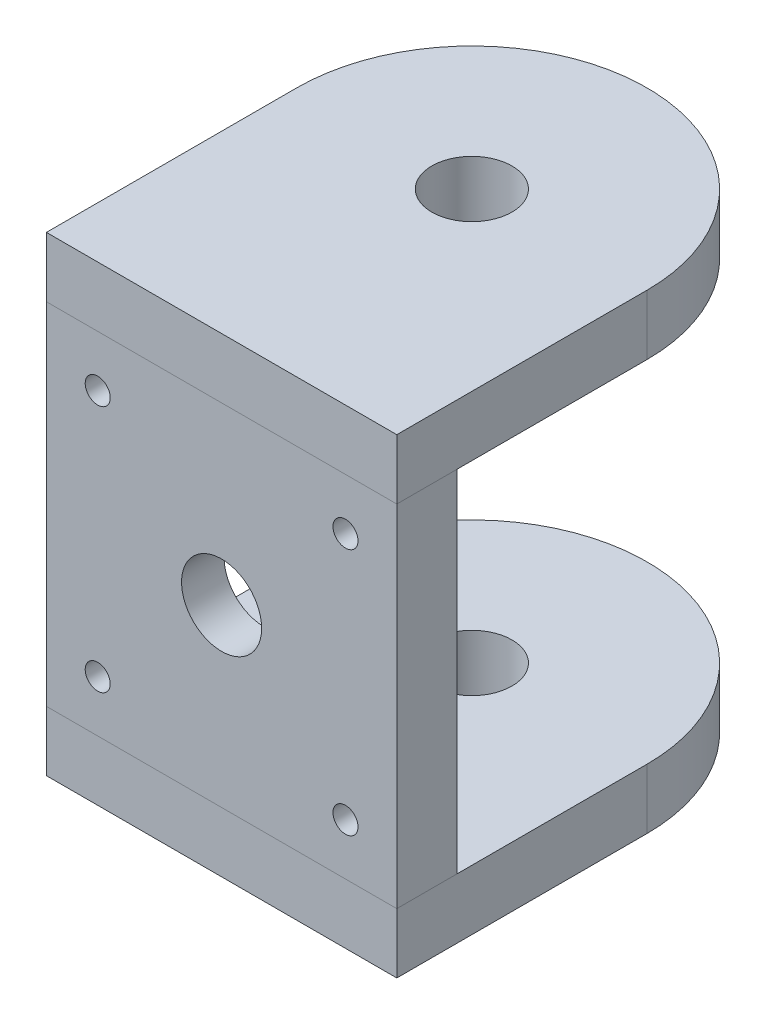
ISO-10303-21;
HEADER;
FILE_DESCRIPTION(('STEP AP214'),'2;1');
FILE_NAME('part.step','',(''),(''),'','','');
FILE_SCHEMA(('AUTOMOTIVE_DESIGN { 1 0 10303 214 1 1 1 1 }'));
ENDSEC;
DATA;
#1=APPLICATION_CONTEXT('core data for automotive mechanical design processes');
#2=APPLICATION_PROTOCOL_DEFINITION('international standard','automotive_design',2000,#1);
#3=PRODUCT_CONTEXT('',#1,'mechanical');
#4=PRODUCT('Part','Part','',(#3));
#5=PRODUCT_RELATED_PRODUCT_CATEGORY('part','',(#4));
#6=PRODUCT_DEFINITION_FORMATION('','',#4);
#7=PRODUCT_DEFINITION_CONTEXT('part definition',#1,'design');
#8=PRODUCT_DEFINITION('design','',#6,#7);
#9=PRODUCT_DEFINITION_SHAPE('','',#8);
#10=(LENGTH_UNIT() NAMED_UNIT(*) SI_UNIT(.MILLI.,.METRE.));
#11=(NAMED_UNIT(*) PLANE_ANGLE_UNIT() SI_UNIT($,.RADIAN.));
#12=(NAMED_UNIT(*) SI_UNIT($,.STERADIAN.) SOLID_ANGLE_UNIT());
#13=UNCERTAINTY_MEASURE_WITH_UNIT(LENGTH_MEASURE(1.E-05),#10,'distance_accuracy_value','');
#14=(GEOMETRIC_REPRESENTATION_CONTEXT(3) GLOBAL_UNCERTAINTY_ASSIGNED_CONTEXT((#13)) GLOBAL_UNIT_ASSIGNED_CONTEXT((#10,
#11,#12)) REPRESENTATION_CONTEXT('',''));
#15=CARTESIAN_POINT('',(0.,0.,0.));
#16=DIRECTION('',(0.,0.,1.));
#17=DIRECTION('',(1.,0.,0.));
#18=AXIS2_PLACEMENT_3D('',#15,#16,#17);
#19=CARTESIAN_POINT('',(35.,-47.,12.));
#20=DIRECTION('',(-1.,0.,0.));
#21=DIRECTION('',(0.,0.,1.));
#22=AXIS2_PLACEMENT_3D('',#19,#20,#21);
#23=PLANE('',#22);
#24=DIRECTION('',(0.,1.,0.));
#25=VECTOR('',#24,1.);
#26=CARTESIAN_POINT('',(35.,-47.,-38.));
#27=LINE('',#26,#25);
#28=CARTESIAN_POINT('',(35.,-47.,-38.));
#29=VERTEX_POINT('',#28);
#30=CARTESIAN_POINT('',(35.,-35.,-38.));
#31=VERTEX_POINT('',#30);
#32=EDGE_CURVE('E111',#29,#31,#27,.T.);
#33=ORIENTED_EDGE('',*,*,#32,.T.);
#34=DIRECTION('',(0.,0.,-1.));
#35=VECTOR('',#34,1.);
#36=CARTESIAN_POINT('',(35.,-35.,12.));
#37=LINE('',#36,#35);
#38=CARTESIAN_POINT('',(35.,-35.,12.));
#39=VERTEX_POINT('',#38);
#40=EDGE_CURVE('E97',#39,#31,#37,.T.);
#41=ORIENTED_EDGE('',*,*,#40,.F.);
#42=DIRECTION('',(0.,1.,0.));
#43=VECTOR('',#42,1.);
#44=CARTESIAN_POINT('',(35.,-47.,12.));
#45=LINE('',#44,#43);
#46=CARTESIAN_POINT('',(35.,-47.,12.));
#47=VERTEX_POINT('',#46);
#48=EDGE_CURVE('E104',#47,#39,#45,.T.);
#49=ORIENTED_EDGE('',*,*,#48,.F.);
#50=DIRECTION('',(0.,0.,-1.));
#51=VECTOR('',#50,1.);
#52=CARTESIAN_POINT('',(35.,-47.,12.));
#53=LINE('',#52,#51);
#54=EDGE_CURVE('E101',#47,#29,#53,.T.);
#55=ORIENTED_EDGE('',*,*,#54,.T.);
#56=EDGE_LOOP('',(#33,#41,#49,#55));
#57=FACE_BOUND('',#56,.T.);
#58=ADVANCED_FACE('F58',(#57),#23,.F.);
#59=CARTESIAN_POINT('',(-35.,-47.,12.));
#60=DIRECTION('',(1.,0.,0.));
#61=DIRECTION('',(0.,0.,-1.));
#62=AXIS2_PLACEMENT_3D('',#59,#60,#61);
#63=PLANE('',#62);
#64=DIRECTION('',(0.,0.,1.));
#65=VECTOR('',#64,1.);
#66=CARTESIAN_POINT('',(-35.,-35.,12.));
#67=LINE('',#66,#65);
#68=CARTESIAN_POINT('',(-35.,-35.,-38.));
#69=VERTEX_POINT('',#68);
#70=CARTESIAN_POINT('',(-35.,-35.,12.));
#71=VERTEX_POINT('',#70);
#72=EDGE_CURVE('E99',#69,#71,#67,.T.);
#73=ORIENTED_EDGE('',*,*,#72,.F.);
#74=DIRECTION('',(0.,1.,0.));
#75=VECTOR('',#74,1.);
#76=CARTESIAN_POINT('',(-35.,-47.,-38.));
#77=LINE('',#76,#75);
#78=CARTESIAN_POINT('',(-35.,-47.,-38.));
#79=VERTEX_POINT('',#78);
#80=EDGE_CURVE('E72',#79,#69,#77,.T.);
#81=ORIENTED_EDGE('',*,*,#80,.F.);
#82=DIRECTION('',(0.,0.,1.));
#83=VECTOR('',#82,1.);
#84=CARTESIAN_POINT('',(-35.,-47.,12.));
#85=LINE('',#84,#83);
#86=CARTESIAN_POINT('',(-35.,-47.,12.));
#87=VERTEX_POINT('',#86);
#88=EDGE_CURVE('E123',#79,#87,#85,.T.);
#89=ORIENTED_EDGE('',*,*,#88,.T.);
#90=DIRECTION('',(0.,1.,0.));
#91=VECTOR('',#90,1.);
#92=CARTESIAN_POINT('',(-35.,-47.,12.));
#93=LINE('',#92,#91);
#94=EDGE_CURVE('E65',#87,#71,#93,.T.);
#95=ORIENTED_EDGE('',*,*,#94,.T.);
#96=EDGE_LOOP('',(#73,#81,#89,#95));
#97=FACE_BOUND('',#96,.T.);
#98=ADVANCED_FACE('F121',(#97),#63,.F.);
#99=CARTESIAN_POINT('',(35.,-47.,12.));
#100=DIRECTION('',(0.,0.,-1.));
#101=DIRECTION('',(-1.,0.,0.));
#102=AXIS2_PLACEMENT_3D('',#99,#100,#101);
#103=PLANE('',#102);
#104=DIRECTION('',(1.,0.,0.));
#105=VECTOR('',#104,1.);
#106=CARTESIAN_POINT('',(35.,-35.,12.));
#107=LINE('',#106,#105);
#108=EDGE_CURVE('E94',#71,#39,#107,.T.);
#109=ORIENTED_EDGE('',*,*,#108,.F.);
#110=ORIENTED_EDGE('',*,*,#94,.F.);
#111=DIRECTION('',(1.,0.,0.));
#112=VECTOR('',#111,1.);
#113=CARTESIAN_POINT('',(35.,-47.,12.));
#114=LINE('',#113,#112);
#115=EDGE_CURVE('E80',#87,#47,#114,.T.);
#116=ORIENTED_EDGE('',*,*,#115,.T.);
#117=ORIENTED_EDGE('',*,*,#48,.T.);
#118=EDGE_LOOP('',(#109,#110,#116,#117));
#119=FACE_BOUND('',#118,.T.);
#120=ADVANCED_FACE('F105',(#119),#103,.F.);
#121=CARTESIAN_POINT('',(0.,-47.,0.));
#122=DIRECTION('',(0.,-1.,0.));
#123=DIRECTION('',(0.,0.,1.));
#124=AXIS2_PLACEMENT_3D('',#121,#122,#123);
#125=PLANE('',#124);
#126=CARTESIAN_POINT('',(0.,-47.,-38.));
#127=DIRECTION('',(0.,-1.,0.));
#128=DIRECTION('',(0.,0.,1.));
#129=AXIS2_PLACEMENT_3D('',#126,#127,#128);
#130=CIRCLE('',#129,35.);
#131=EDGE_CURVE('E130',#79,#29,#130,.T.);
#132=ORIENTED_EDGE('',*,*,#131,.T.);
#133=ORIENTED_EDGE('',*,*,#54,.F.);
#134=ORIENTED_EDGE('',*,*,#115,.F.);
#135=ORIENTED_EDGE('',*,*,#88,.F.);
#136=EDGE_LOOP('',(#132,#133,#134,#135));
#137=FACE_BOUND('',#136,.T.);
#138=CARTESIAN_POINT('',(0.,-47.,-38.));
#139=DIRECTION('',(0.,1.,0.));
#140=DIRECTION('',(0.,0.,1.));
#141=AXIS2_PLACEMENT_3D('',#138,#139,#140);
#142=CIRCLE('',#141,8.);
#143=CARTESIAN_POINT('',(0.,-47.,-30.));
#144=VERTEX_POINT('',#143);
#145=EDGE_CURVE('E116',#144,#144,#142,.T.);
#146=ORIENTED_EDGE('',*,*,#145,.T.);
#147=EDGE_LOOP('',(#146));
#148=FACE_BOUND('',#147,.T.);
#149=ADVANCED_FACE('F127',(#137,#148),#125,.T.);
#150=CARTESIAN_POINT('',(0.,-35.,0.));
#151=DIRECTION('',(0.,-1.,0.));
#152=DIRECTION('',(0.,0.,1.));
#153=AXIS2_PLACEMENT_3D('',#150,#151,#152);
#154=PLANE('',#153);
#155=CARTESIAN_POINT('',(0.,-35.,-38.));
#156=DIRECTION('',(0.,-1.,0.));
#157=DIRECTION('',(0.,0.,-1.));
#158=AXIS2_PLACEMENT_3D('',#155,#156,#157);
#159=CIRCLE('',#158,8.);
#160=CARTESIAN_POINT('',(0.,-35.,-46.));
#161=VERTEX_POINT('',#160);
#162=EDGE_CURVE('E112',#161,#161,#159,.T.);
#163=ORIENTED_EDGE('',*,*,#162,.T.);
#164=EDGE_LOOP('',(#163));
#165=FACE_BOUND('',#164,.T.);
#166=ORIENTED_EDGE('',*,*,#40,.T.);
#167=CARTESIAN_POINT('',(0.,-35.,-38.));
#168=DIRECTION('',(0.,-1.,0.));
#169=DIRECTION('',(0.,0.,-1.));
#170=AXIS2_PLACEMENT_3D('',#167,#168,#169);
#171=CIRCLE('',#170,35.);
#172=EDGE_CURVE('E12',#31,#69,#171,.F.);
#173=ORIENTED_EDGE('',*,*,#172,.T.);
#174=ORIENTED_EDGE('',*,*,#72,.T.);
#175=ORIENTED_EDGE('',*,*,#108,.T.);
#176=EDGE_LOOP('',(#166,#173,#174,#175));
#177=FACE_BOUND('',#176,.T.);
#178=ADVANCED_FACE('F95',(#165,#177),#154,.F.);
#179=CARTESIAN_POINT('',(0.,-47.,-38.));
#180=DIRECTION('',(0.,1.,0.));
#181=DIRECTION('',(0.,0.,1.));
#182=AXIS2_PLACEMENT_3D('',#179,#180,#181);
#183=CYLINDRICAL_SURFACE('',#182,8.);
#184=ORIENTED_EDGE('',*,*,#145,.F.);
#185=EDGE_LOOP('',(#184));
#186=FACE_BOUND('',#185,.T.);
#187=ORIENTED_EDGE('',*,*,#162,.F.);
#188=EDGE_LOOP('',(#187));
#189=FACE_BOUND('',#188,.T.);
#190=ADVANCED_FACE('F143',(#186,#189),#183,.F.);
#191=CARTESIAN_POINT('',(0.,-47.,-38.));
#192=DIRECTION('',(0.,1.,0.));
#193=DIRECTION('',(0.,0.,1.));
#194=AXIS2_PLACEMENT_3D('',#191,#192,#193);
#195=CYLINDRICAL_SURFACE('',#194,35.);
#196=ORIENTED_EDGE('',*,*,#32,.F.);
#197=ORIENTED_EDGE('',*,*,#131,.F.);
#198=ORIENTED_EDGE('',*,*,#80,.T.);
#199=ORIENTED_EDGE('',*,*,#172,.F.);
#200=EDGE_LOOP('',(#196,#197,#198,#199));
#201=FACE_BOUND('',#200,.T.);
#202=ADVANCED_FACE('F146',(#201),#195,.T.);
#203=CLOSED_SHELL('',(#58,#98,#120,#149,#178,#190,#202));
#204=MANIFOLD_SOLID_BREP('B2',#203);
#205=CARTESIAN_POINT('',(35.,47.,12.));
#206=DIRECTION('',(-1.,0.,0.));
#207=DIRECTION('',(0.,0.,1.));
#208=AXIS2_PLACEMENT_3D('',#205,#206,#207);
#209=PLANE('',#208);
#210=DIRECTION('',(0.,1.,0.));
#211=VECTOR('',#210,1.);
#212=CARTESIAN_POINT('',(35.,-47.,-38.));
#213=LINE('',#212,#211);
#214=CARTESIAN_POINT('',(35.,35.,-38.));
#215=VERTEX_POINT('',#214);
#216=CARTESIAN_POINT('',(35.,47.,-38.));
#217=VERTEX_POINT('',#216);
#218=EDGE_CURVE('E233',#215,#217,#213,.T.);
#219=ORIENTED_EDGE('',*,*,#218,.T.);
#220=DIRECTION('',(0.,0.,-1.));
#221=VECTOR('',#220,1.);
#222=CARTESIAN_POINT('',(35.,47.,12.));
#223=LINE('',#222,#221);
#224=CARTESIAN_POINT('',(35.,47.,12.));
#225=VERTEX_POINT('',#224);
#226=EDGE_CURVE('E269',#225,#217,#223,.T.);
#227=ORIENTED_EDGE('',*,*,#226,.F.);
#228=DIRECTION('',(0.,-1.,0.));
#229=VECTOR('',#228,1.);
#230=CARTESIAN_POINT('',(35.,47.,12.));
#231=LINE('',#230,#229);
#232=CARTESIAN_POINT('',(35.,35.,12.));
#233=VERTEX_POINT('',#232);
#234=EDGE_CURVE('E264',#225,#233,#231,.T.);
#235=ORIENTED_EDGE('',*,*,#234,.T.);
#236=DIRECTION('',(0.,0.,-1.));
#237=VECTOR('',#236,1.);
#238=CARTESIAN_POINT('',(35.,35.,12.));
#239=LINE('',#238,#237);
#240=EDGE_CURVE('E274',#233,#215,#239,.T.);
#241=ORIENTED_EDGE('',*,*,#240,.T.);
#242=EDGE_LOOP('',(#219,#227,#235,#241));
#243=FACE_BOUND('',#242,.T.);
#244=ADVANCED_FACE('F216',(#243),#209,.F.);
#245=CARTESIAN_POINT('',(-35.,47.,12.));
#246=DIRECTION('',(1.,0.,0.));
#247=DIRECTION('',(0.,0.,-1.));
#248=AXIS2_PLACEMENT_3D('',#245,#246,#247);
#249=PLANE('',#248);
#250=DIRECTION('',(0.,0.,1.));
#251=VECTOR('',#250,1.);
#252=CARTESIAN_POINT('',(-35.,47.,12.));
#253=LINE('',#252,#251);
#254=CARTESIAN_POINT('',(-35.,47.,-38.));
#255=VERTEX_POINT('',#254);
#256=CARTESIAN_POINT('',(-35.,47.,12.));
#257=VERTEX_POINT('',#256);
#258=EDGE_CURVE('E253',#255,#257,#253,.T.);
#259=ORIENTED_EDGE('',*,*,#258,.F.);
#260=DIRECTION('',(0.,1.,0.));
#261=VECTOR('',#260,1.);
#262=CARTESIAN_POINT('',(-35.,-47.,-38.));
#263=LINE('',#262,#261);
#264=CARTESIAN_POINT('',(-35.,35.,-38.));
#265=VERTEX_POINT('',#264);
#266=EDGE_CURVE('E243',#265,#255,#263,.T.);
#267=ORIENTED_EDGE('',*,*,#266,.F.);
#268=DIRECTION('',(0.,0.,1.));
#269=VECTOR('',#268,1.);
#270=CARTESIAN_POINT('',(-35.,35.,12.));
#271=LINE('',#270,#269);
#272=CARTESIAN_POINT('',(-35.,35.,12.));
#273=VERTEX_POINT('',#272);
#274=EDGE_CURVE('E270',#265,#273,#271,.T.);
#275=ORIENTED_EDGE('',*,*,#274,.T.);
#276=DIRECTION('',(0.,-1.,0.));
#277=VECTOR('',#276,1.);
#278=CARTESIAN_POINT('',(-35.,47.,12.));
#279=LINE('',#278,#277);
#280=EDGE_CURVE('E225',#257,#273,#279,.T.);
#281=ORIENTED_EDGE('',*,*,#280,.F.);
#282=EDGE_LOOP('',(#259,#267,#275,#281));
#283=FACE_BOUND('',#282,.T.);
#284=ADVANCED_FACE('F298',(#283),#249,.F.);
#285=CARTESIAN_POINT('',(35.,47.,12.));
#286=DIRECTION('',(0.,0.,-1.));
#287=DIRECTION('',(-1.,0.,0.));
#288=AXIS2_PLACEMENT_3D('',#285,#286,#287);
#289=PLANE('',#288);
#290=DIRECTION('',(1.,0.,0.));
#291=VECTOR('',#290,1.);
#292=CARTESIAN_POINT('',(35.,35.,12.));
#293=LINE('',#292,#291);
#294=EDGE_CURVE('E260',#273,#233,#293,.T.);
#295=ORIENTED_EDGE('',*,*,#294,.T.);
#296=ORIENTED_EDGE('',*,*,#234,.F.);
#297=DIRECTION('',(1.,0.,0.));
#298=VECTOR('',#297,1.);
#299=CARTESIAN_POINT('',(35.,47.,12.));
#300=LINE('',#299,#298);
#301=EDGE_CURVE('E276',#257,#225,#300,.T.);
#302=ORIENTED_EDGE('',*,*,#301,.F.);
#303=ORIENTED_EDGE('',*,*,#280,.T.);
#304=EDGE_LOOP('',(#295,#296,#302,#303));
#305=FACE_BOUND('',#304,.T.);
#306=ADVANCED_FACE('F262',(#305),#289,.F.);
#307=CARTESIAN_POINT('',(0.,47.,0.));
#308=DIRECTION('',(0.,1.,0.));
#309=DIRECTION('',(0.,0.,1.));
#310=AXIS2_PLACEMENT_3D('',#307,#308,#309);
#311=PLANE('',#310);
#312=CARTESIAN_POINT('',(0.,47.,-38.));
#313=DIRECTION('',(0.,1.,0.));
#314=DIRECTION('',(0.,0.,1.));
#315=AXIS2_PLACEMENT_3D('',#312,#313,#314);
#316=CIRCLE('',#315,35.);
#317=EDGE_CURVE('E219',#255,#217,#316,.F.);
#318=ORIENTED_EDGE('',*,*,#317,.F.);
#319=ORIENTED_EDGE('',*,*,#258,.T.);
#320=ORIENTED_EDGE('',*,*,#301,.T.);
#321=ORIENTED_EDGE('',*,*,#226,.T.);
#322=EDGE_LOOP('',(#318,#319,#320,#321));
#323=FACE_BOUND('',#322,.T.);
#324=CARTESIAN_POINT('',(0.,47.,-38.));
#325=DIRECTION('',(0.,1.,0.));
#326=DIRECTION('',(0.,0.,1.));
#327=AXIS2_PLACEMENT_3D('',#324,#325,#326);
#328=CIRCLE('',#327,8.);
#329=CARTESIAN_POINT('',(0.,47.,-30.));
#330=VERTEX_POINT('',#329);
#331=EDGE_CURVE('E279',#330,#330,#328,.T.);
#332=ORIENTED_EDGE('',*,*,#331,.F.);
#333=EDGE_LOOP('',(#332));
#334=FACE_BOUND('',#333,.T.);
#335=ADVANCED_FACE('F295',(#323,#334),#311,.T.);
#336=CARTESIAN_POINT('',(0.,35.,0.));
#337=DIRECTION('',(0.,1.,0.));
#338=DIRECTION('',(0.,0.,1.));
#339=AXIS2_PLACEMENT_3D('',#336,#337,#338);
#340=PLANE('',#339);
#341=CARTESIAN_POINT('',(0.,35.,-38.));
#342=DIRECTION('',(0.,1.,0.));
#343=DIRECTION('',(0.,0.,1.));
#344=AXIS2_PLACEMENT_3D('',#341,#342,#343);
#345=CIRCLE('',#344,8.);
#346=CARTESIAN_POINT('',(0.,35.,-30.));
#347=VERTEX_POINT('',#346);
#348=EDGE_CURVE('E283',#347,#347,#345,.T.);
#349=ORIENTED_EDGE('',*,*,#348,.T.);
#350=EDGE_LOOP('',(#349));
#351=FACE_BOUND('',#350,.T.);
#352=ORIENTED_EDGE('',*,*,#274,.F.);
#353=CARTESIAN_POINT('',(0.,35.,-38.));
#354=DIRECTION('',(0.,1.,0.));
#355=DIRECTION('',(0.,0.,1.));
#356=AXIS2_PLACEMENT_3D('',#353,#354,#355);
#357=CIRCLE('',#356,35.);
#358=EDGE_CURVE('E56',#265,#215,#357,.F.);
#359=ORIENTED_EDGE('',*,*,#358,.T.);
#360=ORIENTED_EDGE('',*,*,#240,.F.);
#361=ORIENTED_EDGE('',*,*,#294,.F.);
#362=EDGE_LOOP('',(#352,#359,#360,#361));
#363=FACE_BOUND('',#362,.T.);
#364=ADVANCED_FACE('F278',(#351,#363),#340,.F.);
#365=CARTESIAN_POINT('',(0.,-47.,-38.));
#366=DIRECTION('',(0.,1.,0.));
#367=DIRECTION('',(0.,0.,1.));
#368=AXIS2_PLACEMENT_3D('',#365,#366,#367);
#369=CYLINDRICAL_SURFACE('',#368,8.);
#370=ORIENTED_EDGE('',*,*,#331,.T.);
#371=EDGE_LOOP('',(#370));
#372=FACE_BOUND('',#371,.T.);
#373=ORIENTED_EDGE('',*,*,#348,.F.);
#374=EDGE_LOOP('',(#373));
#375=FACE_BOUND('',#374,.T.);
#376=ADVANCED_FACE('F309',(#372,#375),#369,.F.);
#377=CARTESIAN_POINT('',(0.,-47.,-38.));
#378=DIRECTION('',(0.,1.,0.));
#379=DIRECTION('',(0.,0.,1.));
#380=AXIS2_PLACEMENT_3D('',#377,#378,#379);
#381=CYLINDRICAL_SURFACE('',#380,35.);
#382=ORIENTED_EDGE('',*,*,#317,.T.);
#383=ORIENTED_EDGE('',*,*,#218,.F.);
#384=ORIENTED_EDGE('',*,*,#358,.F.);
#385=ORIENTED_EDGE('',*,*,#266,.T.);
#386=EDGE_LOOP('',(#382,#383,#384,#385));
#387=FACE_BOUND('',#386,.T.);
#388=ADVANCED_FACE('F313',(#387),#381,.T.);
#389=CLOSED_SHELL('',(#244,#284,#306,#335,#364,#376,#388));
#390=MANIFOLD_SOLID_BREP('B6',#389);
#391=CARTESIAN_POINT('',(35.,0.,12.));
#392=DIRECTION('',(-1.,0.,0.));
#393=DIRECTION('',(0.,-1.,0.));
#394=AXIS2_PLACEMENT_3D('',#391,#392,#393);
#395=PLANE('',#394);
#396=DIRECTION('',(0.,1.,0.));
#397=VECTOR('',#396,1.);
#398=CARTESIAN_POINT('',(35.,0.,0.));
#399=LINE('',#398,#397);
#400=CARTESIAN_POINT('',(35.,-35.,0.));
#401=VERTEX_POINT('',#400);
#402=CARTESIAN_POINT('',(35.,35.,0.));
#403=VERTEX_POINT('',#402);
#404=EDGE_CURVE('E443',#401,#403,#399,.T.);
#405=ORIENTED_EDGE('',*,*,#404,.T.);
#406=DIRECTION('',(0.,0.,-1.));
#407=VECTOR('',#406,1.);
#408=CARTESIAN_POINT('',(35.,35.,12.));
#409=LINE('',#408,#407);
#410=CARTESIAN_POINT('',(35.,35.,12.));
#411=VERTEX_POINT('',#410);
#412=EDGE_CURVE('E214',#411,#403,#409,.T.);
#413=ORIENTED_EDGE('',*,*,#412,.F.);
#414=DIRECTION('',(0.,1.,0.));
#415=VECTOR('',#414,1.);
#416=CARTESIAN_POINT('',(35.,0.,12.));
#417=LINE('',#416,#415);
#418=CARTESIAN_POINT('',(35.,-35.,12.));
#419=VERTEX_POINT('',#418);
#420=EDGE_CURVE('E413',#419,#411,#417,.T.);
#421=ORIENTED_EDGE('',*,*,#420,.F.);
#422=DIRECTION('',(0.,0.,-1.));
#423=VECTOR('',#422,1.);
#424=CARTESIAN_POINT('',(35.,-35.,12.));
#425=LINE('',#424,#423);
#426=EDGE_CURVE('E379',#419,#401,#425,.T.);
#427=ORIENTED_EDGE('',*,*,#426,.T.);
#428=EDGE_LOOP('',(#405,#413,#421,#427));
#429=FACE_BOUND('',#428,.T.);
#430=ADVANCED_FACE('F361',(#429),#395,.F.);
#431=CARTESIAN_POINT('',(0.,35.,12.));
#432=DIRECTION('',(0.,-1.,0.));
#433=DIRECTION('',(0.,0.,-1.));
#434=AXIS2_PLACEMENT_3D('',#431,#432,#433);
#435=PLANE('',#434);
#436=CARTESIAN_POINT('',(18.,35.,6.));
#437=DIRECTION('',(0.,1.,0.));
#438=DIRECTION('',(0.,0.,-1.));
#439=AXIS2_PLACEMENT_3D('',#436,#437,#438);
#440=CIRCLE('',#439,2.75);
#441=CARTESIAN_POINT('',(18.,35.,3.25));
#442=VERTEX_POINT('',#441);
#443=EDGE_CURVE('E557',#442,#442,#440,.T.);
#444=ORIENTED_EDGE('',*,*,#443,.F.);
#445=EDGE_LOOP('',(#444));
#446=FACE_BOUND('',#445,.T.);
#447=CARTESIAN_POINT('',(-18.,35.,6.));
#448=DIRECTION('',(0.,1.,0.));
#449=DIRECTION('',(0.,0.,1.));
#450=AXIS2_PLACEMENT_3D('',#447,#448,#449);
#451=CIRCLE('',#450,2.75);
#452=CARTESIAN_POINT('',(-18.,35.,8.75));
#453=VERTEX_POINT('',#452);
#454=EDGE_CURVE('E550',#453,#453,#451,.T.);
#455=ORIENTED_EDGE('',*,*,#454,.F.);
#456=EDGE_LOOP('',(#455));
#457=FACE_BOUND('',#456,.T.);
#458=CARTESIAN_POINT('',(0.,35.,6.));
#459=DIRECTION('',(0.,1.,0.));
#460=DIRECTION('',(0.,0.,1.));
#461=AXIS2_PLACEMENT_3D('',#458,#459,#460);
#462=CIRCLE('',#461,2.75);
#463=CARTESIAN_POINT('',(0.,35.,8.75));
#464=VERTEX_POINT('',#463);
#465=EDGE_CURVE('E553',#464,#464,#462,.T.);
#466=ORIENTED_EDGE('',*,*,#465,.F.);
#467=EDGE_LOOP('',(#466));
#468=FACE_BOUND('',#467,.T.);
#469=DIRECTION('',(-1.,0.,0.));
#470=VECTOR('',#469,1.);
#471=CARTESIAN_POINT('',(0.,35.,0.));
#472=LINE('',#471,#470);
#473=CARTESIAN_POINT('',(-35.,35.,0.));
#474=VERTEX_POINT('',#473);
#475=EDGE_CURVE('E418',#403,#474,#472,.T.);
#476=ORIENTED_EDGE('',*,*,#475,.T.);
#477=DIRECTION('',(0.,0.,-1.));
#478=VECTOR('',#477,1.);
#479=CARTESIAN_POINT('',(-35.,35.,12.));
#480=LINE('',#479,#478);
#481=CARTESIAN_POINT('',(-35.,35.,12.));
#482=VERTEX_POINT('',#481);
#483=EDGE_CURVE('E371',#482,#474,#480,.T.);
#484=ORIENTED_EDGE('',*,*,#483,.F.);
#485=DIRECTION('',(-1.,0.,0.));
#486=VECTOR('',#485,1.);
#487=CARTESIAN_POINT('',(0.,35.,12.));
#488=LINE('',#487,#486);
#489=EDGE_CURVE('E404',#411,#482,#488,.T.);
#490=ORIENTED_EDGE('',*,*,#489,.F.);
#491=ORIENTED_EDGE('',*,*,#412,.T.);
#492=EDGE_LOOP('',(#476,#484,#490,#491));
#493=FACE_BOUND('',#492,.T.);
#494=ADVANCED_FACE('F417',(#446,#457,#468,#493),#435,.F.);
#495=CARTESIAN_POINT('',(-35.,0.,12.));
#496=DIRECTION('',(-1.,0.,0.));
#497=DIRECTION('',(0.,0.,1.));
#498=AXIS2_PLACEMENT_3D('',#495,#496,#497);
#499=PLANE('',#498);
#500=DIRECTION('',(0.,1.,0.));
#501=VECTOR('',#500,1.);
#502=CARTESIAN_POINT('',(-35.,0.,0.));
#503=LINE('',#502,#501);
#504=CARTESIAN_POINT('',(-35.,-35.,0.));
#505=VERTEX_POINT('',#504);
#506=EDGE_CURVE('E446',#505,#474,#503,.T.);
#507=ORIENTED_EDGE('',*,*,#506,.F.);
#508=DIRECTION('',(0.,0.,-1.));
#509=VECTOR('',#508,1.);
#510=CARTESIAN_POINT('',(-35.,-35.,12.));
#511=LINE('',#510,#509);
#512=CARTESIAN_POINT('',(-35.,-35.,12.));
#513=VERTEX_POINT('',#512);
#514=EDGE_CURVE('E393',#513,#505,#511,.T.);
#515=ORIENTED_EDGE('',*,*,#514,.F.);
#516=DIRECTION('',(0.,1.,0.));
#517=VECTOR('',#516,1.);
#518=CARTESIAN_POINT('',(-35.,0.,12.));
#519=LINE('',#518,#517);
#520=EDGE_CURVE('E412',#513,#482,#519,.T.);
#521=ORIENTED_EDGE('',*,*,#520,.T.);
#522=ORIENTED_EDGE('',*,*,#483,.T.);
#523=EDGE_LOOP('',(#507,#515,#521,#522));
#524=FACE_BOUND('',#523,.T.);
#525=ADVANCED_FACE('F422',(#524),#499,.T.);
#526=CARTESIAN_POINT('',(0.,-35.,12.));
#527=DIRECTION('',(0.,-1.,0.));
#528=DIRECTION('',(0.,0.,-1.));
#529=AXIS2_PLACEMENT_3D('',#526,#527,#528);
#530=PLANE('',#529);
#531=CARTESIAN_POINT('',(18.,-35.,6.));
#532=DIRECTION('',(0.,1.,0.));
#533=DIRECTION('',(0.,0.,-1.));
#534=AXIS2_PLACEMENT_3D('',#531,#532,#533);
#535=CIRCLE('',#534,2.75);
#536=CARTESIAN_POINT('',(18.,-35.,3.25));
#537=VERTEX_POINT('',#536);
#538=EDGE_CURVE('E531',#537,#537,#535,.T.);
#539=ORIENTED_EDGE('',*,*,#538,.T.);
#540=EDGE_LOOP('',(#539));
#541=FACE_BOUND('',#540,.T.);
#542=CARTESIAN_POINT('',(-18.,-35.,6.));
#543=DIRECTION('',(0.,1.,0.));
#544=DIRECTION('',(0.,0.,1.));
#545=AXIS2_PLACEMENT_3D('',#542,#543,#544);
#546=CIRCLE('',#545,2.75);
#547=CARTESIAN_POINT('',(-18.,-35.,8.75));
#548=VERTEX_POINT('',#547);
#549=EDGE_CURVE('E535',#548,#548,#546,.T.);
#550=ORIENTED_EDGE('',*,*,#549,.T.);
#551=EDGE_LOOP('',(#550));
#552=FACE_BOUND('',#551,.T.);
#553=CARTESIAN_POINT('',(0.,-35.,6.));
#554=DIRECTION('',(0.,1.,0.));
#555=DIRECTION('',(0.,0.,1.));
#556=AXIS2_PLACEMENT_3D('',#553,#554,#555);
#557=CIRCLE('',#556,2.75);
#558=CARTESIAN_POINT('',(0.,-35.,8.75));
#559=VERTEX_POINT('',#558);
#560=EDGE_CURVE('E538',#559,#559,#557,.T.);
#561=ORIENTED_EDGE('',*,*,#560,.T.);
#562=EDGE_LOOP('',(#561));
#563=FACE_BOUND('',#562,.T.);
#564=DIRECTION('',(-1.,0.,0.));
#565=VECTOR('',#564,1.);
#566=CARTESIAN_POINT('',(0.,-35.,0.));
#567=LINE('',#566,#565);
#568=EDGE_CURVE('E448',#401,#505,#567,.T.);
#569=ORIENTED_EDGE('',*,*,#568,.F.);
#570=ORIENTED_EDGE('',*,*,#426,.F.);
#571=DIRECTION('',(-1.,0.,0.));
#572=VECTOR('',#571,1.);
#573=CARTESIAN_POINT('',(0.,-35.,12.));
#574=LINE('',#573,#572);
#575=EDGE_CURVE('E423',#419,#513,#574,.T.);
#576=ORIENTED_EDGE('',*,*,#575,.T.);
#577=ORIENTED_EDGE('',*,*,#514,.T.);
#578=EDGE_LOOP('',(#569,#570,#576,#577));
#579=FACE_BOUND('',#578,.T.);
#580=ADVANCED_FACE('F505',(#541,#552,#563,#579),#530,.T.);
#581=CARTESIAN_POINT('',(-24.7487373415292,-24.7487373415292,12.));
#582=DIRECTION('',(0.,0.,-1.));
#583=DIRECTION('',(-1.,0.,0.));
#584=AXIS2_PLACEMENT_3D('',#581,#582,#583);
#585=CYLINDRICAL_SURFACE('',#584,2.5);
#586=CARTESIAN_POINT('',(-24.7487373415292,-24.7487373415292,12.));
#587=DIRECTION('',(0.,0.,1.));
#588=DIRECTION('',(1.,0.,0.));
#589=AXIS2_PLACEMENT_3D('',#586,#587,#588);
#590=CIRCLE('',#589,2.5);
#591=CARTESIAN_POINT('',(-22.2487373415292,-24.7487373415292,12.));
#592=VERTEX_POINT('',#591);
#593=EDGE_CURVE('E468',#592,#592,#590,.T.);
#594=ORIENTED_EDGE('',*,*,#593,.T.);
#595=EDGE_LOOP('',(#594));
#596=FACE_BOUND('',#595,.T.);
#597=CARTESIAN_POINT('',(-24.7487373415292,-24.7487373415292,0.));
#598=DIRECTION('',(0.,0.,1.));
#599=DIRECTION('',(1.,0.,0.));
#600=AXIS2_PLACEMENT_3D('',#597,#598,#599);
#601=CIRCLE('',#600,2.5);
#602=CARTESIAN_POINT('',(-22.2487373415292,-24.7487373415292,0.));
#603=VERTEX_POINT('',#602);
#604=EDGE_CURVE('E440',#603,#603,#601,.T.);
#605=ORIENTED_EDGE('',*,*,#604,.F.);
#606=EDGE_LOOP('',(#605));
#607=FACE_BOUND('',#606,.T.);
#608=ADVANCED_FACE('F472',(#596,#607),#585,.F.);
#609=CARTESIAN_POINT('',(-24.7487373415291,24.7487373415293,12.));
#610=DIRECTION('',(0.,0.,-1.));
#611=DIRECTION('',(-1.,0.,0.));
#612=AXIS2_PLACEMENT_3D('',#609,#610,#611);
#613=CYLINDRICAL_SURFACE('',#612,2.5);
#614=CARTESIAN_POINT('',(-24.7487373415291,24.7487373415293,12.));
#615=DIRECTION('',(0.,0.,1.));
#616=DIRECTION('',(1.,0.,0.));
#617=AXIS2_PLACEMENT_3D('',#614,#615,#616);
#618=CIRCLE('',#617,2.5);
#619=CARTESIAN_POINT('',(-22.2487373415291,24.7487373415293,12.));
#620=VERTEX_POINT('',#619);
#621=EDGE_CURVE('E460',#620,#620,#618,.T.);
#622=ORIENTED_EDGE('',*,*,#621,.T.);
#623=EDGE_LOOP('',(#622));
#624=FACE_BOUND('',#623,.T.);
#625=CARTESIAN_POINT('',(-24.7487373415291,24.7487373415293,0.));
#626=DIRECTION('',(0.,0.,1.));
#627=DIRECTION('',(1.,0.,0.));
#628=AXIS2_PLACEMENT_3D('',#625,#626,#627);
#629=CIRCLE('',#628,2.5);
#630=CARTESIAN_POINT('',(-22.2487373415291,24.7487373415293,0.));
#631=VERTEX_POINT('',#630);
#632=EDGE_CURVE('E437',#631,#631,#629,.T.);
#633=ORIENTED_EDGE('',*,*,#632,.F.);
#634=EDGE_LOOP('',(#633));
#635=FACE_BOUND('',#634,.T.);
#636=ADVANCED_FACE('F504',(#624,#635),#613,.F.);
#637=CARTESIAN_POINT('',(24.7487373415293,24.748737341529,12.));
#638=DIRECTION('',(0.,0.,-1.));
#639=DIRECTION('',(-1.,0.,0.));
#640=AXIS2_PLACEMENT_3D('',#637,#638,#639);
#641=CYLINDRICAL_SURFACE('',#640,2.5);
#642=CARTESIAN_POINT('',(24.7487373415293,24.748737341529,12.));
#643=DIRECTION('',(0.,0.,1.));
#644=DIRECTION('',(1.,0.,0.));
#645=AXIS2_PLACEMENT_3D('',#642,#643,#644);
#646=CIRCLE('',#645,2.5);
#647=CARTESIAN_POINT('',(27.2487373415293,24.748737341529,12.));
#648=VERTEX_POINT('',#647);
#649=EDGE_CURVE('E455',#648,#648,#646,.T.);
#650=ORIENTED_EDGE('',*,*,#649,.T.);
#651=EDGE_LOOP('',(#650));
#652=FACE_BOUND('',#651,.T.);
#653=CARTESIAN_POINT('',(24.7487373415293,24.748737341529,0.));
#654=DIRECTION('',(0.,0.,1.));
#655=DIRECTION('',(1.,0.,0.));
#656=AXIS2_PLACEMENT_3D('',#653,#654,#655);
#657=CIRCLE('',#656,2.5);
#658=CARTESIAN_POINT('',(27.2487373415293,24.748737341529,0.));
#659=VERTEX_POINT('',#658);
#660=EDGE_CURVE('E434',#659,#659,#657,.T.);
#661=ORIENTED_EDGE('',*,*,#660,.F.);
#662=EDGE_LOOP('',(#661));
#663=FACE_BOUND('',#662,.T.);
#664=ADVANCED_FACE('F507',(#652,#663),#641,.F.);
#665=CARTESIAN_POINT('',(24.7487373415289,-24.7487373415294,12.));
#666=DIRECTION('',(0.,0.,-1.));
#667=DIRECTION('',(-1.,0.,0.));
#668=AXIS2_PLACEMENT_3D('',#665,#666,#667);
#669=CYLINDRICAL_SURFACE('',#668,2.5);
#670=CARTESIAN_POINT('',(24.7487373415289,-24.7487373415294,12.));
#671=DIRECTION('',(0.,0.,1.));
#672=DIRECTION('',(1.,0.,0.));
#673=AXIS2_PLACEMENT_3D('',#670,#671,#672);
#674=CIRCLE('',#673,2.5);
#675=CARTESIAN_POINT('',(27.2487373415289,-24.7487373415294,12.));
#676=VERTEX_POINT('',#675);
#677=EDGE_CURVE('E451',#676,#676,#674,.T.);
#678=ORIENTED_EDGE('',*,*,#677,.T.);
#679=EDGE_LOOP('',(#678));
#680=FACE_BOUND('',#679,.T.);
#681=CARTESIAN_POINT('',(24.7487373415289,-24.7487373415294,0.));
#682=DIRECTION('',(0.,0.,1.));
#683=DIRECTION('',(1.,0.,0.));
#684=AXIS2_PLACEMENT_3D('',#681,#682,#683);
#685=CIRCLE('',#684,2.5);
#686=CARTESIAN_POINT('',(27.2487373415289,-24.7487373415294,0.));
#687=VERTEX_POINT('',#686);
#688=EDGE_CURVE('E431',#687,#687,#685,.T.);
#689=ORIENTED_EDGE('',*,*,#688,.F.);
#690=EDGE_LOOP('',(#689));
#691=FACE_BOUND('',#690,.T.);
#692=ADVANCED_FACE('F363',(#680,#691),#669,.F.);
#693=CARTESIAN_POINT('',(0.,0.,12.));
#694=DIRECTION('',(0.,0.,-1.));
#695=DIRECTION('',(-1.,0.,0.));
#696=AXIS2_PLACEMENT_3D('',#693,#694,#695);
#697=CYLINDRICAL_SURFACE('',#696,8.);
#698=CARTESIAN_POINT('',(0.,0.,3.5));
#699=DIRECTION('',(0.,0.,1.));
#700=DIRECTION('',(1.,0.,0.));
#701=AXIS2_PLACEMENT_3D('',#698,#699,#700);
#702=CIRCLE('',#701,8.);
#703=CARTESIAN_POINT('',(8.,0.,3.5));
#704=VERTEX_POINT('',#703);
#705=EDGE_CURVE('E365',#704,#704,#702,.T.);
#706=ORIENTED_EDGE('',*,*,#705,.F.);
#707=EDGE_LOOP('',(#706));
#708=FACE_BOUND('',#707,.T.);
#709=CARTESIAN_POINT('',(0.,0.,12.));
#710=DIRECTION('',(0.,0.,1.));
#711=DIRECTION('',(1.,0.,0.));
#712=AXIS2_PLACEMENT_3D('',#709,#710,#711);
#713=CIRCLE('',#712,8.);
#714=CARTESIAN_POINT('',(8.,0.,12.));
#715=VERTEX_POINT('',#714);
#716=EDGE_CURVE('E425',#715,#715,#713,.T.);
#717=ORIENTED_EDGE('',*,*,#716,.T.);
#718=EDGE_LOOP('',(#717));
#719=FACE_BOUND('',#718,.T.);
#720=ADVANCED_FACE('F477',(#708,#719),#697,.F.);
#721=CARTESIAN_POINT('',(0.,0.,12.));
#722=DIRECTION('',(0.,0.,1.));
#723=DIRECTION('',(1.,0.,0.));
#724=AXIS2_PLACEMENT_3D('',#721,#722,#723);
#725=PLANE('',#724);
#726=ORIENTED_EDGE('',*,*,#677,.F.);
#727=EDGE_LOOP('',(#726));
#728=FACE_BOUND('',#727,.T.);
#729=ORIENTED_EDGE('',*,*,#649,.F.);
#730=EDGE_LOOP('',(#729));
#731=FACE_BOUND('',#730,.T.);
#732=ORIENTED_EDGE('',*,*,#621,.F.);
#733=EDGE_LOOP('',(#732));
#734=FACE_BOUND('',#733,.T.);
#735=ORIENTED_EDGE('',*,*,#593,.F.);
#736=EDGE_LOOP('',(#735));
#737=FACE_BOUND('',#736,.T.);
#738=ORIENTED_EDGE('',*,*,#420,.T.);
#739=ORIENTED_EDGE('',*,*,#489,.T.);
#740=ORIENTED_EDGE('',*,*,#520,.F.);
#741=ORIENTED_EDGE('',*,*,#575,.F.);
#742=EDGE_LOOP('',(#738,#739,#740,#741));
#743=FACE_BOUND('',#742,.T.);
#744=ORIENTED_EDGE('',*,*,#716,.F.);
#745=EDGE_LOOP('',(#744));
#746=FACE_BOUND('',#745,.T.);
#747=ADVANCED_FACE('F408',(#728,#731,#734,#737,#743,#746),#725,.T.);
#748=CARTESIAN_POINT('',(0.,0.,0.));
#749=DIRECTION('',(0.,0.,1.));
#750=DIRECTION('',(1.,0.,0.));
#751=AXIS2_PLACEMENT_3D('',#748,#749,#750);
#752=PLANE('',#751);
#753=CARTESIAN_POINT('',(0.,0.,0.));
#754=DIRECTION('',(0.,0.,1.));
#755=DIRECTION('',(1.,0.,0.));
#756=AXIS2_PLACEMENT_3D('',#753,#754,#755);
#757=CIRCLE('',#756,25.);
#758=CARTESIAN_POINT('',(25.,0.,0.));
#759=VERTEX_POINT('',#758);
#760=EDGE_CURVE('E463',#759,#759,#757,.T.);
#761=ORIENTED_EDGE('',*,*,#760,.T.);
#762=EDGE_LOOP('',(#761));
#763=FACE_BOUND('',#762,.T.);
#764=ORIENTED_EDGE('',*,*,#688,.T.);
#765=EDGE_LOOP('',(#764));
#766=FACE_BOUND('',#765,.T.);
#767=ORIENTED_EDGE('',*,*,#660,.T.);
#768=EDGE_LOOP('',(#767));
#769=FACE_BOUND('',#768,.T.);
#770=ORIENTED_EDGE('',*,*,#632,.T.);
#771=EDGE_LOOP('',(#770));
#772=FACE_BOUND('',#771,.T.);
#773=ORIENTED_EDGE('',*,*,#604,.T.);
#774=EDGE_LOOP('',(#773));
#775=FACE_BOUND('',#774,.T.);
#776=ORIENTED_EDGE('',*,*,#404,.F.);
#777=ORIENTED_EDGE('',*,*,#568,.T.);
#778=ORIENTED_EDGE('',*,*,#506,.T.);
#779=ORIENTED_EDGE('',*,*,#475,.F.);
#780=EDGE_LOOP('',(#776,#777,#778,#779));
#781=FACE_BOUND('',#780,.T.);
#782=ADVANCED_FACE('F476',(#763,#766,#769,#772,#775,#781),#752,.F.);
#783=CARTESIAN_POINT('',(0.,0.,3.5));
#784=DIRECTION('',(0.,0.,-1.));
#785=DIRECTION('',(-1.,0.,0.));
#786=AXIS2_PLACEMENT_3D('',#783,#784,#785);
#787=CYLINDRICAL_SURFACE('',#786,25.);
#788=CARTESIAN_POINT('',(0.,0.,3.5));
#789=DIRECTION('',(0.,0.,1.));
#790=DIRECTION('',(1.,0.,0.));
#791=AXIS2_PLACEMENT_3D('',#788,#789,#790);
#792=CIRCLE('',#791,25.);
#793=CARTESIAN_POINT('',(25.,0.,3.5));
#794=VERTEX_POINT('',#793);
#795=EDGE_CURVE('E566',#794,#794,#792,.T.);
#796=ORIENTED_EDGE('',*,*,#795,.T.);
#797=EDGE_LOOP('',(#796));
#798=FACE_BOUND('',#797,.T.);
#799=ORIENTED_EDGE('',*,*,#760,.F.);
#800=EDGE_LOOP('',(#799));
#801=FACE_BOUND('',#800,.T.);
#802=ADVANCED_FACE('F485',(#798,#801),#787,.F.);
#803=CARTESIAN_POINT('',(0.,0.,3.5));
#804=DIRECTION('',(0.,0.,1.));
#805=DIRECTION('',(1.,0.,0.));
#806=AXIS2_PLACEMENT_3D('',#803,#804,#805);
#807=PLANE('',#806);
#808=ORIENTED_EDGE('',*,*,#705,.T.);
#809=EDGE_LOOP('',(#808));
#810=FACE_BOUND('',#809,.T.);
#811=ORIENTED_EDGE('',*,*,#795,.F.);
#812=EDGE_LOOP('',(#811));
#813=FACE_BOUND('',#812,.T.);
#814=ADVANCED_FACE('F576',(#810,#813),#807,.F.);
#815=CARTESIAN_POINT('',(0.,27.,6.));
#816=DIRECTION('',(0.,1.,0.));
#817=DIRECTION('',(0.,0.,1.));
#818=AXIS2_PLACEMENT_3D('',#815,#816,#817);
#819=CYLINDRICAL_SURFACE('',#818,2.75);
#820=CARTESIAN_POINT('',(0.,27.,6.));
#821=DIRECTION('',(0.,1.,0.));
#822=DIRECTION('',(0.,0.,1.));
#823=AXIS2_PLACEMENT_3D('',#820,#821,#822);
#824=CIRCLE('',#823,2.75);
#825=CARTESIAN_POINT('',(0.,27.,8.75));
#826=VERTEX_POINT('',#825);
#827=EDGE_CURVE('E562',#826,#826,#824,.T.);
#828=ORIENTED_EDGE('',*,*,#827,.F.);
#829=EDGE_LOOP('',(#828));
#830=FACE_BOUND('',#829,.T.);
#831=ORIENTED_EDGE('',*,*,#465,.T.);
#832=EDGE_LOOP('',(#831));
#833=FACE_BOUND('',#832,.T.);
#834=ADVANCED_FACE('F580',(#830,#833),#819,.F.);
#835=CARTESIAN_POINT('',(0.,27.,6.));
#836=DIRECTION('',(0.,1.,0.));
#837=DIRECTION('',(0.,0.,1.));
#838=AXIS2_PLACEMENT_3D('',#835,#836,#837);
#839=PLANE('',#838);
#840=ORIENTED_EDGE('',*,*,#827,.T.);
#841=EDGE_LOOP('',(#840));
#842=FACE_BOUND('',#841,.T.);
#843=ADVANCED_FACE('F586',(#842),#839,.T.);
#844=CARTESIAN_POINT('',(-18.,27.,6.));
#845=DIRECTION('',(0.,1.,0.));
#846=DIRECTION('',(0.,0.,1.));
#847=AXIS2_PLACEMENT_3D('',#844,#845,#846);
#848=CYLINDRICAL_SURFACE('',#847,2.75);
#849=CARTESIAN_POINT('',(-18.,27.,6.));
#850=DIRECTION('',(0.,1.,0.));
#851=DIRECTION('',(0.,0.,1.));
#852=AXIS2_PLACEMENT_3D('',#849,#850,#851);
#853=CIRCLE('',#852,2.75);
#854=CARTESIAN_POINT('',(-18.,27.,8.75));
#855=VERTEX_POINT('',#854);
#856=EDGE_CURVE('E554',#855,#855,#853,.T.);
#857=ORIENTED_EDGE('',*,*,#856,.F.);
#858=EDGE_LOOP('',(#857));
#859=FACE_BOUND('',#858,.T.);
#860=ORIENTED_EDGE('',*,*,#454,.T.);
#861=EDGE_LOOP('',(#860));
#862=FACE_BOUND('',#861,.T.);
#863=ADVANCED_FACE('F590',(#859,#862),#848,.F.);
#864=CARTESIAN_POINT('',(-18.,27.,6.));
#865=DIRECTION('',(0.,1.,0.));
#866=DIRECTION('',(0.,0.,1.));
#867=AXIS2_PLACEMENT_3D('',#864,#865,#866);
#868=PLANE('',#867);
#869=ORIENTED_EDGE('',*,*,#856,.T.);
#870=EDGE_LOOP('',(#869));
#871=FACE_BOUND('',#870,.T.);
#872=ADVANCED_FACE('F599',(#871),#868,.T.);
#873=CARTESIAN_POINT('',(18.,27.,6.));
#874=DIRECTION('',(0.,1.,0.));
#875=DIRECTION('',(0.,0.,1.));
#876=AXIS2_PLACEMENT_3D('',#873,#874,#875);
#877=CYLINDRICAL_SURFACE('',#876,2.75);
#878=CARTESIAN_POINT('',(18.,27.,6.));
#879=DIRECTION('',(0.,1.,0.));
#880=DIRECTION('',(0.,0.,-1.));
#881=AXIS2_PLACEMENT_3D('',#878,#879,#880);
#882=CIRCLE('',#881,2.75);
#883=CARTESIAN_POINT('',(18.,27.,3.25));
#884=VERTEX_POINT('',#883);
#885=EDGE_CURVE('E544',#884,#884,#882,.T.);
#886=ORIENTED_EDGE('',*,*,#885,.F.);
#887=EDGE_LOOP('',(#886));
#888=FACE_BOUND('',#887,.T.);
#889=ORIENTED_EDGE('',*,*,#443,.T.);
#890=EDGE_LOOP('',(#889));
#891=FACE_BOUND('',#890,.T.);
#892=ADVANCED_FACE('F595',(#888,#891),#877,.F.);
#893=CARTESIAN_POINT('',(18.,27.,6.));
#894=DIRECTION('',(0.,-1.,0.));
#895=DIRECTION('',(0.,0.,-1.));
#896=AXIS2_PLACEMENT_3D('',#893,#894,#895);
#897=PLANE('',#896);
#898=ORIENTED_EDGE('',*,*,#885,.T.);
#899=EDGE_LOOP('',(#898));
#900=FACE_BOUND('',#899,.T.);
#901=ADVANCED_FACE('F592',(#900),#897,.F.);
#902=CARTESIAN_POINT('',(0.,-27.,6.));
#903=DIRECTION('',(0.,-1.,0.));
#904=DIRECTION('',(0.,0.,-1.));
#905=AXIS2_PLACEMENT_3D('',#902,#903,#904);
#906=CYLINDRICAL_SURFACE('',#905,2.75);
#907=CARTESIAN_POINT('',(0.,-27.,6.));
#908=DIRECTION('',(0.,1.,0.));
#909=DIRECTION('',(0.,0.,1.));
#910=AXIS2_PLACEMENT_3D('',#907,#908,#909);
#911=CIRCLE('',#910,2.75);
#912=CARTESIAN_POINT('',(0.,-27.,8.75));
#913=VERTEX_POINT('',#912);
#914=EDGE_CURVE('E540',#913,#913,#911,.T.);
#915=ORIENTED_EDGE('',*,*,#914,.T.);
#916=EDGE_LOOP('',(#915));
#917=FACE_BOUND('',#916,.T.);
#918=ORIENTED_EDGE('',*,*,#560,.F.);
#919=EDGE_LOOP('',(#918));
#920=FACE_BOUND('',#919,.T.);
#921=ADVANCED_FACE('F594',(#917,#920),#906,.F.);
#922=CARTESIAN_POINT('',(0.,-27.,6.));
#923=DIRECTION('',(0.,-1.,0.));
#924=DIRECTION('',(0.,0.,1.));
#925=AXIS2_PLACEMENT_3D('',#922,#923,#924);
#926=PLANE('',#925);
#927=ORIENTED_EDGE('',*,*,#914,.F.);
#928=EDGE_LOOP('',(#927));
#929=FACE_BOUND('',#928,.T.);
#930=ADVANCED_FACE('F608',(#929),#926,.T.);
#931=CARTESIAN_POINT('',(-18.,-27.,6.));
#932=DIRECTION('',(0.,-1.,0.));
#933=DIRECTION('',(0.,0.,-1.));
#934=AXIS2_PLACEMENT_3D('',#931,#932,#933);
#935=CYLINDRICAL_SURFACE('',#934,2.75);
#936=CARTESIAN_POINT('',(-18.,-27.,6.));
#937=DIRECTION('',(0.,1.,0.));
#938=DIRECTION('',(0.,0.,1.));
#939=AXIS2_PLACEMENT_3D('',#936,#937,#938);
#940=CIRCLE('',#939,2.75);
#941=CARTESIAN_POINT('',(-18.,-27.,8.75));
#942=VERTEX_POINT('',#941);
#943=EDGE_CURVE('E541',#942,#942,#940,.T.);
#944=ORIENTED_EDGE('',*,*,#943,.T.);
#945=EDGE_LOOP('',(#944));
#946=FACE_BOUND('',#945,.T.);
#947=ORIENTED_EDGE('',*,*,#549,.F.);
#948=EDGE_LOOP('',(#947));
#949=FACE_BOUND('',#948,.T.);
#950=ADVANCED_FACE('F612',(#946,#949),#935,.F.);
#951=CARTESIAN_POINT('',(-18.,-27.,6.));
#952=DIRECTION('',(0.,-1.,0.));
#953=DIRECTION('',(0.,0.,1.));
#954=AXIS2_PLACEMENT_3D('',#951,#952,#953);
#955=PLANE('',#954);
#956=ORIENTED_EDGE('',*,*,#943,.F.);
#957=EDGE_LOOP('',(#956));
#958=FACE_BOUND('',#957,.T.);
#959=ADVANCED_FACE('F618',(#958),#955,.T.);
#960=CARTESIAN_POINT('',(18.,-27.,6.));
#961=DIRECTION('',(0.,-1.,0.));
#962=DIRECTION('',(0.,0.,-1.));
#963=AXIS2_PLACEMENT_3D('',#960,#961,#962);
#964=CYLINDRICAL_SURFACE('',#963,2.75);
#965=CARTESIAN_POINT('',(18.,-27.,6.));
#966=DIRECTION('',(0.,1.,0.));
#967=DIRECTION('',(0.,0.,-1.));
#968=AXIS2_PLACEMENT_3D('',#965,#966,#967);
#969=CIRCLE('',#968,2.75);
#970=CARTESIAN_POINT('',(18.,-27.,3.25));
#971=VERTEX_POINT('',#970);
#972=EDGE_CURVE('E632',#971,#971,#969,.T.);
#973=ORIENTED_EDGE('',*,*,#972,.T.);
#974=EDGE_LOOP('',(#973));
#975=FACE_BOUND('',#974,.T.);
#976=ORIENTED_EDGE('',*,*,#538,.F.);
#977=EDGE_LOOP('',(#976));
#978=FACE_BOUND('',#977,.T.);
#979=ADVANCED_FACE('F614',(#975,#978),#964,.F.);
#980=CARTESIAN_POINT('',(18.,-27.,6.));
#981=DIRECTION('',(0.,1.,0.));
#982=DIRECTION('',(0.,0.,-1.));
#983=AXIS2_PLACEMENT_3D('',#980,#981,#982);
#984=PLANE('',#983);
#985=ORIENTED_EDGE('',*,*,#972,.F.);
#986=EDGE_LOOP('',(#985));
#987=FACE_BOUND('',#986,.T.);
#988=ADVANCED_FACE('F617',(#987),#984,.F.);
#989=CLOSED_SHELL('',(#430,#494,#525,#580,#608,#636,#664,#692,#720,#747,#782,#802,#814,#834,
#843,#863,#872,#892,#901,#921,#930,#950,#959,#979,#988));
#990=MANIFOLD_SOLID_BREP('B50',#989);
#991=ADVANCED_BREP_SHAPE_REPRESENTATION('',(#18,#204,#390,#990),#14);
#992=SHAPE_DEFINITION_REPRESENTATION(#9,#991);
ENDSEC;
END-ISO-10303-21;
